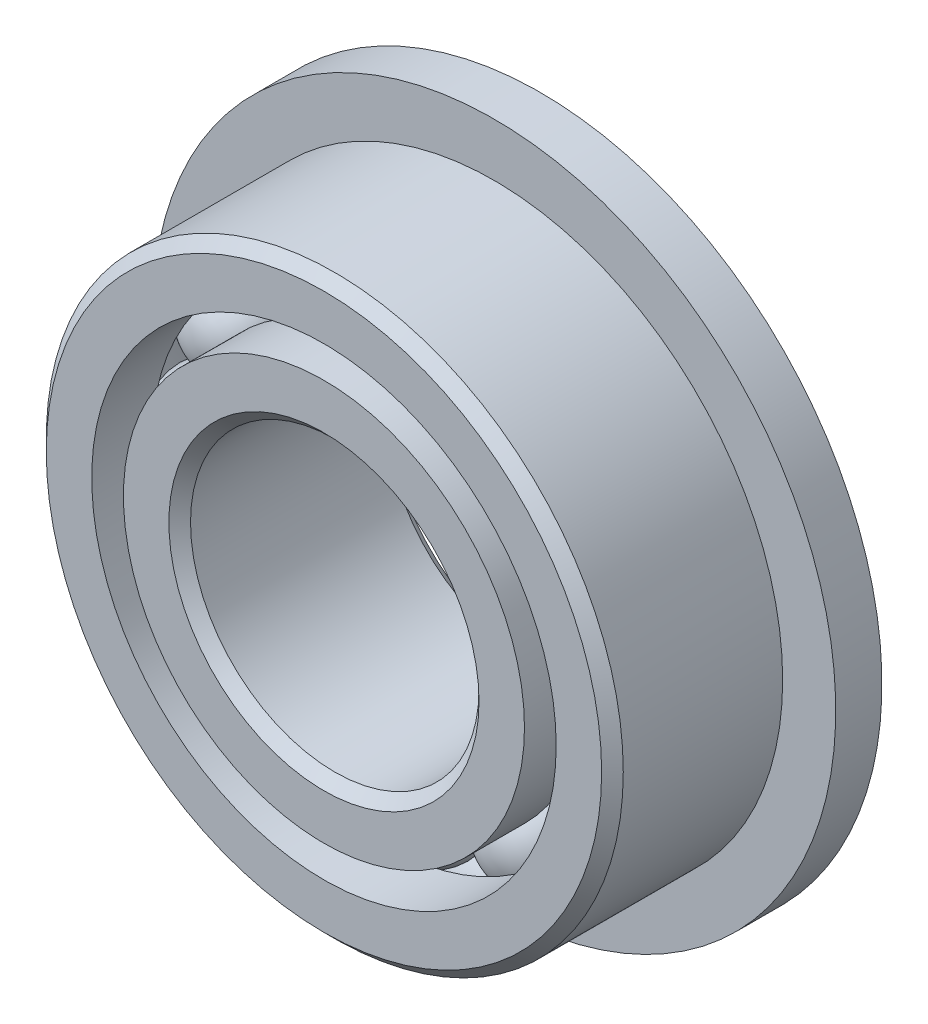
ISO-10303-21;
HEADER;
FILE_DESCRIPTION(('STEP AP214'),'2;1');
FILE_NAME('part.step','',(''),(''),'','','');
FILE_SCHEMA(('AUTOMOTIVE_DESIGN { 1 0 10303 214 1 1 1 1 }'));
ENDSEC;
DATA;
#1=APPLICATION_CONTEXT('core data for automotive mechanical design processes');
#2=APPLICATION_PROTOCOL_DEFINITION('international standard','automotive_design',2000,#1);
#3=PRODUCT_CONTEXT('',#1,'mechanical');
#4=PRODUCT('Part','Part','',(#3));
#5=PRODUCT_RELATED_PRODUCT_CATEGORY('part','',(#4));
#6=PRODUCT_DEFINITION_FORMATION('','',#4);
#7=PRODUCT_DEFINITION_CONTEXT('part definition',#1,'design');
#8=PRODUCT_DEFINITION('design','',#6,#7);
#9=PRODUCT_DEFINITION_SHAPE('','',#8);
#10=(LENGTH_UNIT() NAMED_UNIT(*) SI_UNIT(.MILLI.,.METRE.));
#11=(NAMED_UNIT(*) PLANE_ANGLE_UNIT() SI_UNIT($,.RADIAN.));
#12=(NAMED_UNIT(*) SI_UNIT($,.STERADIAN.) SOLID_ANGLE_UNIT());
#13=UNCERTAINTY_MEASURE_WITH_UNIT(LENGTH_MEASURE(1.E-05),#10,'distance_accuracy_value','');
#14=(GEOMETRIC_REPRESENTATION_CONTEXT(3) GLOBAL_UNCERTAINTY_ASSIGNED_CONTEXT((#13)) GLOBAL_UNIT_ASSIGNED_CONTEXT((#10,
#11,#12)) REPRESENTATION_CONTEXT('',''));
#15=CARTESIAN_POINT('',(0.,0.,0.));
#16=DIRECTION('',(0.,0.,1.));
#17=DIRECTION('',(1.,0.,0.));
#18=AXIS2_PLACEMENT_3D('',#15,#16,#17);
#19=CARTESIAN_POINT('',(-1.19062499999997,2.06222299276171,0.));
#20=DIRECTION('',(0.,0.,1.));
#21=DIRECTION('',(0.499999999999989,-0.866025403784445,0.));
#22=AXIS2_PLACEMENT_3D('',#19,#20,#21);
#23=SPHERICAL_SURFACE('',#22,0.557180720515983);
#24=CARTESIAN_POINT('',(-1.19062499999997,2.06222299276171,0.557180720515982));
#25=VERTEX_POINT('',#24);
#26=VERTEX_LOOP('',#25);
#27=FACE_BOUND('',#26,.T.);
#28=ADVANCED_FACE('F37',(#27),#23,.T.);
#29=CLOSED_SHELL('',(#28));
#30=MANIFOLD_SOLID_BREP('B2',#29);
#31=CARTESIAN_POINT('',(-2.06222299276168,1.19062500000002,0.));
#32=DIRECTION('',(0.,0.,1.));
#33=DIRECTION('',(0.866025403784433,-0.50000000000001,0.));
#34=AXIS2_PLACEMENT_3D('',#31,#32,#33);
#35=SPHERICAL_SURFACE('',#34,0.557180720515983);
#36=CARTESIAN_POINT('',(-2.06222299276168,1.19062500000002,0.557180720515982));
#37=VERTEX_POINT('',#36);
#38=VERTEX_LOOP('',#37);
#39=FACE_BOUND('',#38,.T.);
#40=ADVANCED_FACE('F57',(#39),#35,.T.);
#41=CLOSED_SHELL('',(#40));
#42=MANIFOLD_SOLID_BREP('B6',#41);
#43=CARTESIAN_POINT('',(-2.38125,0.,0.));
#44=DIRECTION('',(0.,0.,1.));
#45=DIRECTION('',(1.,0.,0.));
#46=AXIS2_PLACEMENT_3D('',#43,#44,#45);
#47=SPHERICAL_SURFACE('',#46,0.557180720515983);
#48=CARTESIAN_POINT('',(-2.38125,0.,0.557180720515982));
#49=VERTEX_POINT('',#48);
#50=VERTEX_LOOP('',#49);
#51=FACE_BOUND('',#50,.T.);
#52=ADVANCED_FACE('F77',(#51),#47,.T.);
#53=CLOSED_SHELL('',(#52));
#54=MANIFOLD_SOLID_BREP('B33',#53);
#55=CARTESIAN_POINT('',(-2.06222299276171,-1.19062499999998,0.));
#56=DIRECTION('',(0.,0.,1.));
#57=DIRECTION('',(0.866025403784443,0.499999999999992,0.));
#58=AXIS2_PLACEMENT_3D('',#55,#56,#57);
#59=SPHERICAL_SURFACE('',#58,0.557180720515983);
#60=CARTESIAN_POINT('',(-2.06222299276171,-1.19062499999998,0.557180720515982));
#61=VERTEX_POINT('',#60);
#62=VERTEX_LOOP('',#61);
#63=FACE_BOUND('',#62,.T.);
#64=ADVANCED_FACE('F97',(#63),#59,.T.);
#65=CLOSED_SHELL('',(#64));
#66=MANIFOLD_SOLID_BREP('B53',#65);
#67=CARTESIAN_POINT('',(-1.19062500000002,-2.06222299276169,0.));
#68=DIRECTION('',(0.,0.,1.));
#69=DIRECTION('',(0.500000000000007,0.866025403784435,0.));
#70=AXIS2_PLACEMENT_3D('',#67,#68,#69);
#71=SPHERICAL_SURFACE('',#70,0.557180720515983);
#72=CARTESIAN_POINT('',(-1.19062500000002,-2.06222299276169,0.557180720515982));
#73=VERTEX_POINT('',#72);
#74=VERTEX_LOOP('',#73);
#75=FACE_BOUND('',#74,.T.);
#76=ADVANCED_FACE('F117',(#75),#71,.T.);
#77=CLOSED_SHELL('',(#76));
#78=MANIFOLD_SOLID_BREP('B73',#77);
#79=CARTESIAN_POINT('',(0.,-2.38125,0.));
#80=DIRECTION('',(0.,0.,1.));
#81=DIRECTION('',(0.,1.,0.));
#82=AXIS2_PLACEMENT_3D('',#79,#80,#81);
#83=SPHERICAL_SURFACE('',#82,0.557180720515983);
#84=CARTESIAN_POINT('',(0.,-2.38125,0.557180720515982));
#85=VERTEX_POINT('',#84);
#86=VERTEX_LOOP('',#85);
#87=FACE_BOUND('',#86,.T.);
#88=ADVANCED_FACE('F137',(#87),#83,.T.);
#89=CLOSED_SHELL('',(#88));
#90=MANIFOLD_SOLID_BREP('B93',#89);
#91=CARTESIAN_POINT('',(1.19062499999999,-2.0622229927617,0.));
#92=DIRECTION('',(0.,0.,1.));
#93=DIRECTION('',(-0.499999999999995,0.866025403784442,0.));
#94=AXIS2_PLACEMENT_3D('',#91,#92,#93);
#95=SPHERICAL_SURFACE('',#94,0.557180720515983);
#96=CARTESIAN_POINT('',(1.19062499999999,-2.0622229927617,0.557180720515982));
#97=VERTEX_POINT('',#96);
#98=VERTEX_LOOP('',#97);
#99=FACE_BOUND('',#98,.T.);
#100=ADVANCED_FACE('F157',(#99),#95,.T.);
#101=CLOSED_SHELL('',(#100));
#102=MANIFOLD_SOLID_BREP('B113',#101);
#103=CARTESIAN_POINT('',(2.06222299276169,-1.19062500000001,0.));
#104=DIRECTION('',(0.,0.,1.));
#105=DIRECTION('',(-0.866025403784436,0.500000000000004,0.));
#106=AXIS2_PLACEMENT_3D('',#103,#104,#105);
#107=SPHERICAL_SURFACE('',#106,0.557180720515983);
#108=CARTESIAN_POINT('',(2.06222299276169,-1.19062500000001,0.557180720515982));
#109=VERTEX_POINT('',#108);
#110=VERTEX_LOOP('',#109);
#111=FACE_BOUND('',#110,.T.);
#112=ADVANCED_FACE('F177',(#111),#107,.T.);
#113=CLOSED_SHELL('',(#112));
#114=MANIFOLD_SOLID_BREP('B133',#113);
#115=CARTESIAN_POINT('',(2.38125,0.,0.));
#116=DIRECTION('',(0.,0.,1.));
#117=DIRECTION('',(-1.,0.,0.));
#118=AXIS2_PLACEMENT_3D('',#115,#116,#117);
#119=SPHERICAL_SURFACE('',#118,0.557180720515983);
#120=CARTESIAN_POINT('',(2.38125,0.,0.557180720515982));
#121=VERTEX_POINT('',#120);
#122=VERTEX_LOOP('',#121);
#123=FACE_BOUND('',#122,.T.);
#124=ADVANCED_FACE('F197',(#123),#119,.T.);
#125=CLOSED_SHELL('',(#124));
#126=MANIFOLD_SOLID_BREP('B153',#125);
#127=CARTESIAN_POINT('',(2.0622229927617,1.190625,0.));
#128=DIRECTION('',(0.,0.,1.));
#129=DIRECTION('',(-0.86602540378444,-0.499999999999998,0.));
#130=AXIS2_PLACEMENT_3D('',#127,#128,#129);
#131=SPHERICAL_SURFACE('',#130,0.557180720515983);
#132=CARTESIAN_POINT('',(2.0622229927617,1.190625,0.557180720515982));
#133=VERTEX_POINT('',#132);
#134=VERTEX_LOOP('',#133);
#135=FACE_BOUND('',#134,.T.);
#136=ADVANCED_FACE('F217',(#135),#131,.T.);
#137=CLOSED_SHELL('',(#136));
#138=MANIFOLD_SOLID_BREP('B173',#137);
#139=CARTESIAN_POINT('',(1.190625,2.06222299276169,0.));
#140=DIRECTION('',(0.,0.,1.));
#141=DIRECTION('',(-0.500000000000001,-0.866025403784438,0.));
#142=AXIS2_PLACEMENT_3D('',#139,#140,#141);
#143=SPHERICAL_SURFACE('',#142,0.557180720515983);
#144=CARTESIAN_POINT('',(1.190625,2.06222299276169,0.557180720515982));
#145=VERTEX_POINT('',#144);
#146=VERTEX_LOOP('',#145);
#147=FACE_BOUND('',#146,.T.);
#148=ADVANCED_FACE('F237',(#147),#143,.T.);
#149=CLOSED_SHELL('',(#148));
#150=MANIFOLD_SOLID_BREP('B193',#149);
#151=CARTESIAN_POINT('',(0.,2.38125,0.));
#152=DIRECTION('',(0.,0.,1.));
#153=DIRECTION('',(0.,-1.,0.));
#154=AXIS2_PLACEMENT_3D('',#151,#152,#153);
#155=SPHERICAL_SURFACE('',#154,0.557180720515983);
#156=CARTESIAN_POINT('',(0.,2.38125,0.557180720515982));
#157=VERTEX_POINT('',#156);
#158=VERTEX_LOOP('',#157);
#159=FACE_BOUND('',#158,.T.);
#160=ADVANCED_FACE('F259',(#159),#155,.T.);
#161=CLOSED_SHELL('',(#160));
#162=MANIFOLD_SOLID_BREP('B213',#161);
#163=CARTESIAN_POINT('',(0.,2.20679945054945,1.190625));
#164=DIRECTION('',(0.,0.,-1.));
#165=DIRECTION('',(-1.,0.,0.));
#166=AXIS2_PLACEMENT_3D('',#163,#164,#165);
#167=PLANE('',#166);
#168=CARTESIAN_POINT('',(0.,0.,1.190625));
#169=DIRECTION('',(0.,0.,1.));
#170=DIRECTION('',(1.,0.,0.));
#171=AXIS2_PLACEMENT_3D('',#168,#169,#170);
#172=CIRCLE('',#171,1.7065625);
#173=CARTESIAN_POINT('',(1.7065625,0.,1.190625));
#174=VERTEX_POINT('',#173);
#175=EDGE_CURVE('E306',#174,#174,#172,.T.);
#176=ORIENTED_EDGE('',*,*,#175,.F.);
#177=EDGE_LOOP('',(#176));
#178=FACE_BOUND('',#177,.T.);
#179=CARTESIAN_POINT('',(0.,0.,1.190625));
#180=DIRECTION('',(0.,0.,1.));
#181=DIRECTION('',(1.,0.,0.));
#182=AXIS2_PLACEMENT_3D('',#179,#180,#181);
#183=CIRCLE('',#182,2.20679945054945);
#184=CARTESIAN_POINT('',(2.20679945054945,0.,1.190625));
#185=VERTEX_POINT('',#184);
#186=EDGE_CURVE('E258',#185,#185,#183,.T.);
#187=ORIENTED_EDGE('',*,*,#186,.T.);
#188=EDGE_LOOP('',(#187));
#189=FACE_BOUND('',#188,.T.);
#190=ADVANCED_FACE('F278',(#178,#189),#167,.F.);
#191=CARTESIAN_POINT('',(0.,0.,1.190625));
#192=DIRECTION('',(0.,0.,1.));
#193=DIRECTION('',(1.,0.,0.));
#194=AXIS2_PLACEMENT_3D('',#191,#192,#193);
#195=CYLINDRICAL_SURFACE('',#194,2.20679945054945);
#196=ORIENTED_EDGE('',*,*,#186,.F.);
#197=EDGE_LOOP('',(#196));
#198=FACE_BOUND('',#197,.T.);
#199=CARTESIAN_POINT('',(0.,0.,0.529166666666666));
#200=DIRECTION('',(0.,0.,1.));
#201=DIRECTION('',(1.,0.,0.));
#202=AXIS2_PLACEMENT_3D('',#199,#200,#201);
#203=CIRCLE('',#202,2.20679945054945);
#204=CARTESIAN_POINT('',(2.20679945054945,0.,0.529166666666666));
#205=VERTEX_POINT('',#204);
#206=EDGE_CURVE('E284',#205,#205,#203,.T.);
#207=ORIENTED_EDGE('',*,*,#206,.T.);
#208=EDGE_LOOP('',(#207));
#209=FACE_BOUND('',#208,.T.);
#210=ADVANCED_FACE('F313',(#198,#209),#195,.T.);
#211=CARTESIAN_POINT('',(0.,0.,0.));
#212=DIRECTION('',(0.,0.,1.));
#213=DIRECTION('',(1.,0.,0.));
#214=AXIS2_PLACEMENT_3D('',#211,#212,#213);
#215=TOROIDAL_SURFACE('',#214,2.38125,0.557180720515983);
#216=ORIENTED_EDGE('',*,*,#206,.F.);
#217=EDGE_LOOP('',(#216));
#218=FACE_BOUND('',#217,.T.);
#219=CARTESIAN_POINT('',(0.,0.,-0.529166666666668));
#220=DIRECTION('',(0.,0.,1.));
#221=DIRECTION('',(1.,0.,0.));
#222=AXIS2_PLACEMENT_3D('',#219,#220,#221);
#223=CIRCLE('',#222,2.20679945054945);
#224=CARTESIAN_POINT('',(2.20679945054945,0.,-0.529166666666668));
#225=VERTEX_POINT('',#224);
#226=EDGE_CURVE('E288',#225,#225,#223,.T.);
#227=ORIENTED_EDGE('',*,*,#226,.T.);
#228=EDGE_LOOP('',(#227));
#229=FACE_BOUND('',#228,.T.);
#230=ADVANCED_FACE('F317',(#218,#229),#215,.F.);
#231=CARTESIAN_POINT('',(0.,0.,1.190625));
#232=DIRECTION('',(0.,0.,1.));
#233=DIRECTION('',(1.,0.,0.));
#234=AXIS2_PLACEMENT_3D('',#231,#232,#233);
#235=CYLINDRICAL_SURFACE('',#234,2.20679945054945);
#236=ORIENTED_EDGE('',*,*,#226,.F.);
#237=EDGE_LOOP('',(#236));
#238=FACE_BOUND('',#237,.T.);
#239=CARTESIAN_POINT('',(0.,0.,-1.190625));
#240=DIRECTION('',(0.,0.,1.));
#241=DIRECTION('',(1.,0.,0.));
#242=AXIS2_PLACEMENT_3D('',#239,#240,#241);
#243=CIRCLE('',#242,2.20679945054945);
#244=CARTESIAN_POINT('',(2.20679945054945,0.,-1.190625));
#245=VERTEX_POINT('',#244);
#246=EDGE_CURVE('E292',#245,#245,#243,.T.);
#247=ORIENTED_EDGE('',*,*,#246,.T.);
#248=EDGE_LOOP('',(#247));
#249=FACE_BOUND('',#248,.T.);
#250=ADVANCED_FACE('F322',(#238,#249),#235,.T.);
#251=CARTESIAN_POINT('',(0.,1.7065625,-1.190625));
#252=DIRECTION('',(0.,0.,1.));
#253=DIRECTION('',(1.,0.,0.));
#254=AXIS2_PLACEMENT_3D('',#251,#252,#253);
#255=PLANE('',#254);
#256=ORIENTED_EDGE('',*,*,#246,.F.);
#257=EDGE_LOOP('',(#256));
#258=FACE_BOUND('',#257,.T.);
#259=CARTESIAN_POINT('',(0.,0.,-1.190625));
#260=DIRECTION('',(0.,0.,1.));
#261=DIRECTION('',(1.,0.,0.));
#262=AXIS2_PLACEMENT_3D('',#259,#260,#261);
#263=CIRCLE('',#262,1.7065625);
#264=CARTESIAN_POINT('',(1.7065625,0.,-1.190625));
#265=VERTEX_POINT('',#264);
#266=EDGE_CURVE('E297',#265,#265,#263,.T.);
#267=ORIENTED_EDGE('',*,*,#266,.T.);
#268=EDGE_LOOP('',(#267));
#269=FACE_BOUND('',#268,.T.);
#270=ADVANCED_FACE('F328',(#258,#269),#255,.F.);
#271=CARTESIAN_POINT('',(0.,0.,-1.0715625));
#272=DIRECTION('',(0.,0.,-1.));
#273=DIRECTION('',(-1.,0.,0.));
#274=AXIS2_PLACEMENT_3D('',#271,#272,#273);
#275=CONICAL_SURFACE('',#274,1.5875,0.78539816339744);
#276=ORIENTED_EDGE('',*,*,#266,.F.);
#277=EDGE_LOOP('',(#276));
#278=FACE_BOUND('',#277,.T.);
#279=CARTESIAN_POINT('',(0.,0.,-1.0715625));
#280=DIRECTION('',(0.,0.,1.));
#281=DIRECTION('',(1.,0.,0.));
#282=AXIS2_PLACEMENT_3D('',#279,#280,#281);
#283=CIRCLE('',#282,1.5875);
#284=CARTESIAN_POINT('',(1.5875,0.,-1.0715625));
#285=VERTEX_POINT('',#284);
#286=EDGE_CURVE('E300',#285,#285,#283,.T.);
#287=ORIENTED_EDGE('',*,*,#286,.T.);
#288=EDGE_LOOP('',(#287));
#289=FACE_BOUND('',#288,.T.);
#290=ADVANCED_FACE('F332',(#278,#289),#275,.F.);
#291=CARTESIAN_POINT('',(0.,0.,1.190625));
#292=DIRECTION('',(0.,0.,1.));
#293=DIRECTION('',(1.,0.,0.));
#294=AXIS2_PLACEMENT_3D('',#291,#292,#293);
#295=CYLINDRICAL_SURFACE('',#294,1.5875);
#296=ORIENTED_EDGE('',*,*,#286,.F.);
#297=EDGE_LOOP('',(#296));
#298=FACE_BOUND('',#297,.T.);
#299=CARTESIAN_POINT('',(0.,0.,1.0715625));
#300=DIRECTION('',(0.,0.,1.));
#301=DIRECTION('',(1.,0.,0.));
#302=AXIS2_PLACEMENT_3D('',#299,#300,#301);
#303=CIRCLE('',#302,1.5875);
#304=CARTESIAN_POINT('',(1.5875,0.,1.0715625));
#305=VERTEX_POINT('',#304);
#306=EDGE_CURVE('E303',#305,#305,#303,.T.);
#307=ORIENTED_EDGE('',*,*,#306,.T.);
#308=EDGE_LOOP('',(#307));
#309=FACE_BOUND('',#308,.T.);
#310=ADVANCED_FACE('F336',(#298,#309),#295,.F.);
#311=CARTESIAN_POINT('',(0.,0.,1.190625));
#312=DIRECTION('',(0.,0.,1.));
#313=DIRECTION('',(1.,0.,0.));
#314=AXIS2_PLACEMENT_3D('',#311,#312,#313);
#315=CONICAL_SURFACE('',#314,1.7065625,0.785398163397456);
#316=ORIENTED_EDGE('',*,*,#306,.F.);
#317=EDGE_LOOP('',(#316));
#318=FACE_BOUND('',#317,.T.);
#319=ORIENTED_EDGE('',*,*,#175,.T.);
#320=EDGE_LOOP('',(#319));
#321=FACE_BOUND('',#320,.T.);
#322=ADVANCED_FACE('F310',(#318,#321),#315,.F.);
#323=CLOSED_SHELL('',(#190,#210,#230,#250,#270,#290,#310,#322));
#324=MANIFOLD_SOLID_BREP('B233',#323);
#325=CARTESIAN_POINT('',(0.,0.,1.0715625));
#326=DIRECTION('',(0.,0.,-1.));
#327=DIRECTION('',(-1.,0.,0.));
#328=AXIS2_PLACEMENT_3D('',#325,#326,#327);
#329=CONICAL_SURFACE('',#328,3.175,0.785398163397445);
#330=CARTESIAN_POINT('',(0.,0.,1.190625));
#331=DIRECTION('',(0.,0.,1.));
#332=DIRECTION('',(1.,0.,0.));
#333=AXIS2_PLACEMENT_3D('',#330,#331,#332);
#334=CIRCLE('',#333,3.0559375);
#335=CARTESIAN_POINT('',(3.0559375,0.,1.190625));
#336=VERTEX_POINT('',#335);
#337=EDGE_CURVE('E421',#336,#336,#334,.T.);
#338=ORIENTED_EDGE('',*,*,#337,.F.);
#339=EDGE_LOOP('',(#338));
#340=FACE_BOUND('',#339,.T.);
#341=CARTESIAN_POINT('',(0.,0.,1.0715625));
#342=DIRECTION('',(0.,0.,1.));
#343=DIRECTION('',(1.,0.,0.));
#344=AXIS2_PLACEMENT_3D('',#341,#342,#343);
#345=CIRCLE('',#344,3.175);
#346=CARTESIAN_POINT('',(3.175,0.,1.0715625));
#347=VERTEX_POINT('',#346);
#348=EDGE_CURVE('E277',#347,#347,#345,.T.);
#349=ORIENTED_EDGE('',*,*,#348,.T.);
#350=EDGE_LOOP('',(#349));
#351=FACE_BOUND('',#350,.T.);
#352=ADVANCED_FACE('F399',(#340,#351),#329,.T.);
#353=CARTESIAN_POINT('',(0.,0.,1.190625));
#354=DIRECTION('',(0.,0.,1.));
#355=DIRECTION('',(1.,0.,0.));
#356=AXIS2_PLACEMENT_3D('',#353,#354,#355);
#357=CYLINDRICAL_SURFACE('',#356,3.175);
#358=CARTESIAN_POINT('',(0.,0.,-0.682625000000001));
#359=DIRECTION('',(0.,0.,1.));
#360=DIRECTION('',(1.,0.,0.));
#361=AXIS2_PLACEMENT_3D('',#358,#359,#360);
#362=CIRCLE('',#361,3.175);
#363=CARTESIAN_POINT('',(3.175,0.,-0.682625000000001));
#364=VERTEX_POINT('',#363);
#365=EDGE_CURVE('E402',#364,#364,#362,.T.);
#366=ORIENTED_EDGE('',*,*,#365,.T.);
#367=EDGE_LOOP('',(#366));
#368=FACE_BOUND('',#367,.T.);
#369=ORIENTED_EDGE('',*,*,#348,.F.);
#370=EDGE_LOOP('',(#369));
#371=FACE_BOUND('',#370,.T.);
#372=ADVANCED_FACE('F442',(#368,#371),#357,.T.);
#373=CARTESIAN_POINT('',(0.,3.0559375,-1.190625));
#374=DIRECTION('',(0.,0.,1.));
#375=DIRECTION('',(1.,0.,0.));
#376=AXIS2_PLACEMENT_3D('',#373,#374,#375);
#377=PLANE('',#376);
#378=CARTESIAN_POINT('',(0.,0.,-1.190625));
#379=DIRECTION('',(0.,0.,1.));
#380=DIRECTION('',(1.,0.,0.));
#381=AXIS2_PLACEMENT_3D('',#378,#379,#380);
#382=CIRCLE('',#381,2.55570054945055);
#383=CARTESIAN_POINT('',(2.55570054945055,0.,-1.190625));
#384=VERTEX_POINT('',#383);
#385=EDGE_CURVE('E406',#384,#384,#382,.T.);
#386=ORIENTED_EDGE('',*,*,#385,.T.);
#387=EDGE_LOOP('',(#386));
#388=FACE_BOUND('',#387,.T.);
#389=CARTESIAN_POINT('',(0.,0.,-1.190625));
#390=DIRECTION('',(0.,0.,-1.));
#391=DIRECTION('',(-1.,0.,0.));
#392=AXIS2_PLACEMENT_3D('',#389,#390,#391);
#393=CIRCLE('',#392,3.7592);
#394=CARTESIAN_POINT('',(-3.7592,0.,-1.190625));
#395=VERTEX_POINT('',#394);
#396=EDGE_CURVE('E424',#395,#395,#393,.T.);
#397=ORIENTED_EDGE('',*,*,#396,.T.);
#398=EDGE_LOOP('',(#397));
#399=FACE_BOUND('',#398,.T.);
#400=ADVANCED_FACE('F445',(#388,#399),#377,.F.);
#401=CARTESIAN_POINT('',(0.,0.,1.190625));
#402=DIRECTION('',(0.,0.,1.));
#403=DIRECTION('',(1.,0.,0.));
#404=AXIS2_PLACEMENT_3D('',#401,#402,#403);
#405=CYLINDRICAL_SURFACE('',#404,2.55570054945055);
#406=ORIENTED_EDGE('',*,*,#385,.F.);
#407=EDGE_LOOP('',(#406));
#408=FACE_BOUND('',#407,.T.);
#409=CARTESIAN_POINT('',(0.,0.,-0.529166666666667));
#410=DIRECTION('',(0.,0.,1.));
#411=DIRECTION('',(1.,0.,0.));
#412=AXIS2_PLACEMENT_3D('',#409,#410,#411);
#413=CIRCLE('',#412,2.55570054945055);
#414=CARTESIAN_POINT('',(2.55570054945055,0.,-0.529166666666667));
#415=VERTEX_POINT('',#414);
#416=EDGE_CURVE('E410',#415,#415,#413,.T.);
#417=ORIENTED_EDGE('',*,*,#416,.T.);
#418=EDGE_LOOP('',(#417));
#419=FACE_BOUND('',#418,.T.);
#420=ADVANCED_FACE('F450',(#408,#419),#405,.F.);
#421=CARTESIAN_POINT('',(0.,0.,0.));
#422=DIRECTION('',(0.,0.,1.));
#423=DIRECTION('',(1.,0.,0.));
#424=AXIS2_PLACEMENT_3D('',#421,#422,#423);
#425=TOROIDAL_SURFACE('',#424,2.38125,0.557180720515983);
#426=ORIENTED_EDGE('',*,*,#416,.F.);
#427=EDGE_LOOP('',(#426));
#428=FACE_BOUND('',#427,.T.);
#429=CARTESIAN_POINT('',(0.,0.,0.529166666666666));
#430=DIRECTION('',(0.,0.,1.));
#431=DIRECTION('',(1.,0.,0.));
#432=AXIS2_PLACEMENT_3D('',#429,#430,#431);
#433=CIRCLE('',#432,2.55570054945055);
#434=CARTESIAN_POINT('',(2.55570054945055,0.,0.529166666666666));
#435=VERTEX_POINT('',#434);
#436=EDGE_CURVE('E415',#435,#435,#433,.T.);
#437=ORIENTED_EDGE('',*,*,#436,.T.);
#438=EDGE_LOOP('',(#437));
#439=FACE_BOUND('',#438,.T.);
#440=ADVANCED_FACE('F457',(#428,#439),#425,.F.);
#441=CARTESIAN_POINT('',(0.,0.,1.190625));
#442=DIRECTION('',(0.,0.,1.));
#443=DIRECTION('',(1.,0.,0.));
#444=AXIS2_PLACEMENT_3D('',#441,#442,#443);
#445=CYLINDRICAL_SURFACE('',#444,2.55570054945055);
#446=ORIENTED_EDGE('',*,*,#436,.F.);
#447=EDGE_LOOP('',(#446));
#448=FACE_BOUND('',#447,.T.);
#449=CARTESIAN_POINT('',(0.,0.,1.190625));
#450=DIRECTION('',(0.,0.,1.));
#451=DIRECTION('',(1.,0.,0.));
#452=AXIS2_PLACEMENT_3D('',#449,#450,#451);
#453=CIRCLE('',#452,2.55570054945055);
#454=CARTESIAN_POINT('',(2.55570054945055,0.,1.190625));
#455=VERTEX_POINT('',#454);
#456=EDGE_CURVE('E418',#455,#455,#453,.T.);
#457=ORIENTED_EDGE('',*,*,#456,.T.);
#458=EDGE_LOOP('',(#457));
#459=FACE_BOUND('',#458,.T.);
#460=ADVANCED_FACE('F461',(#448,#459),#445,.F.);
#461=CARTESIAN_POINT('',(0.,3.0559375,1.190625));
#462=DIRECTION('',(0.,0.,-1.));
#463=DIRECTION('',(-1.,0.,0.));
#464=AXIS2_PLACEMENT_3D('',#461,#462,#463);
#465=PLANE('',#464);
#466=ORIENTED_EDGE('',*,*,#456,.F.);
#467=EDGE_LOOP('',(#466));
#468=FACE_BOUND('',#467,.T.);
#469=ORIENTED_EDGE('',*,*,#337,.T.);
#470=EDGE_LOOP('',(#469));
#471=FACE_BOUND('',#470,.T.);
#472=ADVANCED_FACE('F437',(#468,#471),#465,.F.);
#473=CARTESIAN_POINT('',(0.,2.80581902472527,-0.682625000000001));
#474=DIRECTION('',(0.,0.,1.));
#475=DIRECTION('',(1.,0.,0.));
#476=AXIS2_PLACEMENT_3D('',#473,#474,#475);
#477=PLANE('',#476);
#478=CARTESIAN_POINT('',(0.,0.,-0.682625000000001));
#479=DIRECTION('',(0.,0.,-1.));
#480=DIRECTION('',(-1.,0.,0.));
#481=AXIS2_PLACEMENT_3D('',#478,#479,#480);
#482=CIRCLE('',#481,3.7592);
#483=CARTESIAN_POINT('',(-3.7592,0.,-0.682625000000001));
#484=VERTEX_POINT('',#483);
#485=EDGE_CURVE('E427',#484,#484,#482,.T.);
#486=ORIENTED_EDGE('',*,*,#485,.F.);
#487=EDGE_LOOP('',(#486));
#488=FACE_BOUND('',#487,.T.);
#489=ORIENTED_EDGE('',*,*,#365,.F.);
#490=EDGE_LOOP('',(#489));
#491=FACE_BOUND('',#490,.T.);
#492=ADVANCED_FACE('F434',(#488,#491),#477,.T.);
#493=CARTESIAN_POINT('',(0.,0.,-1.190625));
#494=DIRECTION('',(0.,0.,-1.));
#495=DIRECTION('',(-1.,0.,0.));
#496=AXIS2_PLACEMENT_3D('',#493,#494,#495);
#497=CYLINDRICAL_SURFACE('',#496,3.7592);
#498=ORIENTED_EDGE('',*,*,#485,.T.);
#499=EDGE_LOOP('',(#498));
#500=FACE_BOUND('',#499,.T.);
#501=ORIENTED_EDGE('',*,*,#396,.F.);
#502=EDGE_LOOP('',(#501));
#503=FACE_BOUND('',#502,.T.);
#504=ADVANCED_FACE('F431',(#500,#503),#497,.T.);
#505=CLOSED_SHELL('',(#352,#372,#400,#420,#440,#460,#472,#492,#504));
#506=MANIFOLD_SOLID_BREP('B253',#505);
#507=ADVANCED_BREP_SHAPE_REPRESENTATION('',(#18,#30,#42,#54,#66,#78,#90,#102,#114,#126,#138,
#150,#162,#324,#506),#14);
#508=SHAPE_DEFINITION_REPRESENTATION(#9,#507);
ENDSEC;
END-ISO-10303-21;
